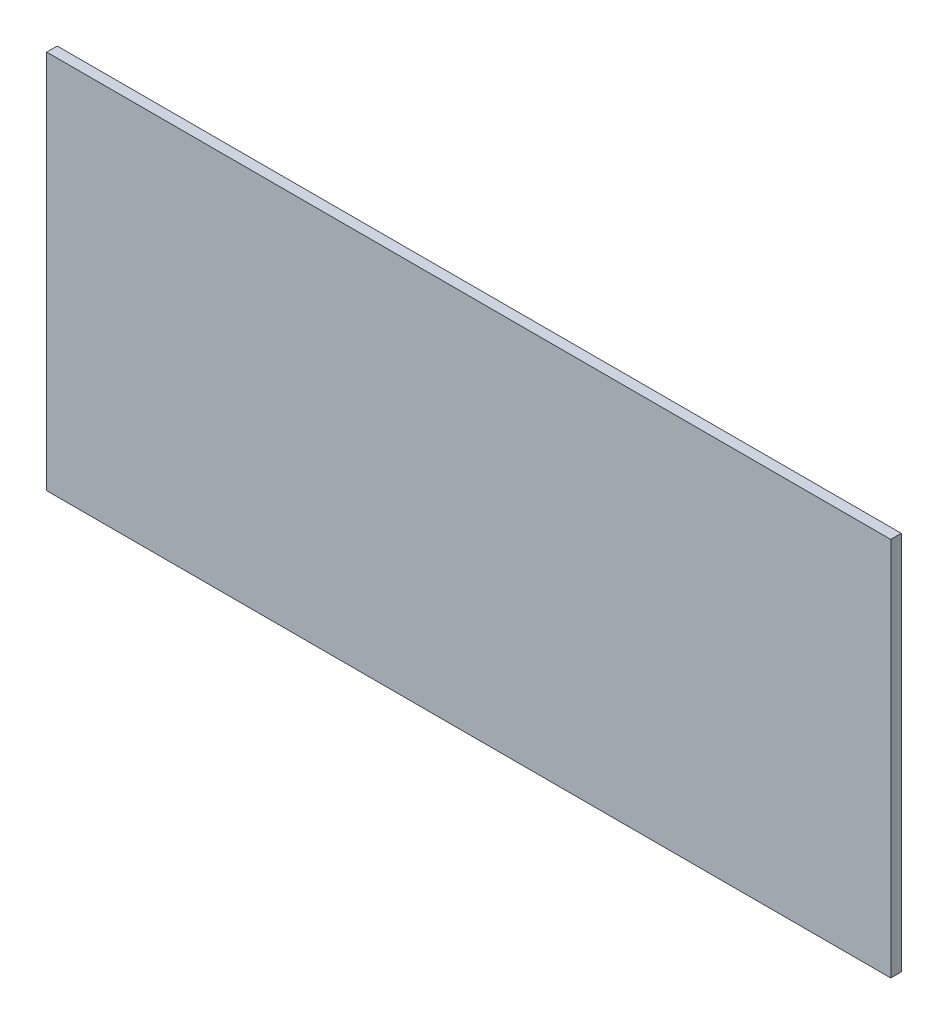
ISO-10303-21;
HEADER;
FILE_DESCRIPTION(('STEP AP214'),'2;1');
FILE_NAME('part.step','',(''),(''),'','','');
FILE_SCHEMA(('AUTOMOTIVE_DESIGN { 1 0 10303 214 1 1 1 1 }'));
ENDSEC;
DATA;
#1=APPLICATION_CONTEXT('core data for automotive mechanical design processes');
#2=APPLICATION_PROTOCOL_DEFINITION('international standard','automotive_design',2000,#1);
#3=PRODUCT_CONTEXT('',#1,'mechanical');
#4=PRODUCT('Part','Part','',(#3));
#5=PRODUCT_RELATED_PRODUCT_CATEGORY('part','',(#4));
#6=PRODUCT_DEFINITION_FORMATION('','',#4);
#7=PRODUCT_DEFINITION_CONTEXT('part definition',#1,'design');
#8=PRODUCT_DEFINITION('design','',#6,#7);
#9=PRODUCT_DEFINITION_SHAPE('','',#8);
#10=(LENGTH_UNIT() NAMED_UNIT(*) SI_UNIT(.MILLI.,.METRE.));
#11=(NAMED_UNIT(*) PLANE_ANGLE_UNIT() SI_UNIT($,.RADIAN.));
#12=(NAMED_UNIT(*) SI_UNIT($,.STERADIAN.) SOLID_ANGLE_UNIT());
#13=UNCERTAINTY_MEASURE_WITH_UNIT(LENGTH_MEASURE(1.E-05),#10,'distance_accuracy_value','');
#14=(GEOMETRIC_REPRESENTATION_CONTEXT(3) GLOBAL_UNCERTAINTY_ASSIGNED_CONTEXT((#13)) GLOBAL_UNIT_ASSIGNED_CONTEXT((#10,
#11,#12)) REPRESENTATION_CONTEXT('',''));
#15=CARTESIAN_POINT('',(0.,0.,0.));
#16=DIRECTION('',(0.,0.,1.));
#17=DIRECTION('',(1.,0.,0.));
#18=AXIS2_PLACEMENT_3D('',#15,#16,#17);
#19=CARTESIAN_POINT('',(0.,0.,25.4));
#20=DIRECTION('',(1.,0.,0.));
#21=DIRECTION('',(0.,1.,0.));
#22=AXIS2_PLACEMENT_3D('',#19,#20,#21);
#23=PLANE('',#22);
#24=DIRECTION('',(0.,-1.,0.));
#25=VECTOR('',#24,1.);
#26=CARTESIAN_POINT('',(0.,0.,0.));
#27=LINE('',#26,#25);
#28=CARTESIAN_POINT('',(0.,0.,0.));
#29=VERTEX_POINT('',#28);
#30=CARTESIAN_POINT('',(1.11981703314034E-13,-914.4,0.));
#31=VERTEX_POINT('',#30);
#32=EDGE_CURVE('E100',#29,#31,#27,.T.);
#33=ORIENTED_EDGE('',*,*,#32,.T.);
#34=DIRECTION('',(0.,0.,-1.));
#35=VECTOR('',#34,1.);
#36=CARTESIAN_POINT('',(1.11981703314034E-13,-914.4,25.4));
#37=LINE('',#36,#35);
#38=CARTESIAN_POINT('',(1.11981703314034E-13,-914.4,25.4));
#39=VERTEX_POINT('',#38);
#40=EDGE_CURVE('E11',#39,#31,#37,.T.);
#41=ORIENTED_EDGE('',*,*,#40,.F.);
#42=DIRECTION('',(0.,-1.,0.));
#43=VECTOR('',#42,1.);
#44=CARTESIAN_POINT('',(0.,0.,25.4));
#45=LINE('',#44,#43);
#46=CARTESIAN_POINT('',(0.,0.,25.4));
#47=VERTEX_POINT('',#46);
#48=EDGE_CURVE('E88',#47,#39,#45,.T.);
#49=ORIENTED_EDGE('',*,*,#48,.F.);
#50=DIRECTION('',(0.,0.,-1.));
#51=VECTOR('',#50,1.);
#52=CARTESIAN_POINT('',(0.,0.,25.4));
#53=LINE('',#52,#51);
#54=EDGE_CURVE('E96',#47,#29,#53,.T.);
#55=ORIENTED_EDGE('',*,*,#54,.T.);
#56=EDGE_LOOP('',(#33,#41,#49,#55));
#57=FACE_BOUND('',#56,.T.);
#58=ADVANCED_FACE('F37',(#57),#23,.F.);
#59=CARTESIAN_POINT('',(1.11981703314034E-13,-914.4,25.4));
#60=DIRECTION('',(0.,1.,0.));
#61=DIRECTION('',(0.,0.,1.));
#62=AXIS2_PLACEMENT_3D('',#59,#60,#61);
#63=PLANE('',#62);
#64=DIRECTION('',(1.,0.,0.));
#65=VECTOR('',#64,1.);
#66=CARTESIAN_POINT('',(1.11981703314034E-13,-914.4,0.));
#67=LINE('',#66,#65);
#68=CARTESIAN_POINT('',(2032.,-914.4,0.));
#69=VERTEX_POINT('',#68);
#70=EDGE_CURVE('E92',#31,#69,#67,.T.);
#71=ORIENTED_EDGE('',*,*,#70,.T.);
#72=DIRECTION('',(0.,0.,-1.));
#73=VECTOR('',#72,1.);
#74=CARTESIAN_POINT('',(2032.,-914.4,25.4));
#75=LINE('',#74,#73);
#76=CARTESIAN_POINT('',(2032.,-914.4,25.4));
#77=VERTEX_POINT('',#76);
#78=EDGE_CURVE('E45',#77,#69,#75,.T.);
#79=ORIENTED_EDGE('',*,*,#78,.F.);
#80=DIRECTION('',(1.,0.,0.));
#81=VECTOR('',#80,1.);
#82=CARTESIAN_POINT('',(1.11981703314034E-13,-914.4,25.4));
#83=LINE('',#82,#81);
#84=EDGE_CURVE('E83',#39,#77,#83,.T.);
#85=ORIENTED_EDGE('',*,*,#84,.F.);
#86=ORIENTED_EDGE('',*,*,#40,.T.);
#87=EDGE_LOOP('',(#71,#79,#85,#86));
#88=FACE_BOUND('',#87,.T.);
#89=ADVANCED_FACE('F91',(#88),#63,.F.);
#90=CARTESIAN_POINT('',(2032.,0.,25.4));
#91=DIRECTION('',(-1.,0.,0.));
#92=DIRECTION('',(0.,0.,1.));
#93=AXIS2_PLACEMENT_3D('',#90,#91,#92);
#94=PLANE('',#93);
#95=DIRECTION('',(0.,1.,0.));
#96=VECTOR('',#95,1.);
#97=CARTESIAN_POINT('',(2032.,0.,0.));
#98=LINE('',#97,#96);
#99=CARTESIAN_POINT('',(2032.,0.,0.));
#100=VERTEX_POINT('',#99);
#101=EDGE_CURVE('E70',#69,#100,#98,.T.);
#102=ORIENTED_EDGE('',*,*,#101,.T.);
#103=DIRECTION('',(0.,0.,-1.));
#104=VECTOR('',#103,1.);
#105=CARTESIAN_POINT('',(2032.,0.,25.4));
#106=LINE('',#105,#104);
#107=CARTESIAN_POINT('',(2032.,0.,25.4));
#108=VERTEX_POINT('',#107);
#109=EDGE_CURVE('E93',#108,#100,#106,.T.);
#110=ORIENTED_EDGE('',*,*,#109,.F.);
#111=DIRECTION('',(0.,1.,0.));
#112=VECTOR('',#111,1.);
#113=CARTESIAN_POINT('',(2032.,0.,25.4));
#114=LINE('',#113,#112);
#115=EDGE_CURVE('E86',#77,#108,#114,.T.);
#116=ORIENTED_EDGE('',*,*,#115,.F.);
#117=ORIENTED_EDGE('',*,*,#78,.T.);
#118=EDGE_LOOP('',(#102,#110,#116,#117));
#119=FACE_BOUND('',#118,.T.);
#120=ADVANCED_FACE('F94',(#119),#94,.F.);
#121=CARTESIAN_POINT('',(0.,0.,25.4));
#122=DIRECTION('',(0.,-1.,0.));
#123=DIRECTION('',(0.,0.,-1.));
#124=AXIS2_PLACEMENT_3D('',#121,#122,#123);
#125=PLANE('',#124);
#126=DIRECTION('',(-1.,0.,0.));
#127=VECTOR('',#126,1.);
#128=CARTESIAN_POINT('',(0.,0.,0.));
#129=LINE('',#128,#127);
#130=EDGE_CURVE('E76',#100,#29,#129,.T.);
#131=ORIENTED_EDGE('',*,*,#130,.T.);
#132=ORIENTED_EDGE('',*,*,#54,.F.);
#133=DIRECTION('',(-1.,0.,0.));
#134=VECTOR('',#133,1.);
#135=CARTESIAN_POINT('',(0.,0.,25.4));
#136=LINE('',#135,#134);
#137=EDGE_CURVE('E53',#108,#47,#136,.T.);
#138=ORIENTED_EDGE('',*,*,#137,.F.);
#139=ORIENTED_EDGE('',*,*,#109,.T.);
#140=EDGE_LOOP('',(#131,#132,#138,#139));
#141=FACE_BOUND('',#140,.T.);
#142=ADVANCED_FACE('F107',(#141),#125,.F.);
#143=CARTESIAN_POINT('',(0.,0.,25.4));
#144=DIRECTION('',(0.,0.,1.));
#145=DIRECTION('',(1.,0.,0.));
#146=AXIS2_PLACEMENT_3D('',#143,#144,#145);
#147=PLANE('',#146);
#148=ORIENTED_EDGE('',*,*,#48,.T.);
#149=ORIENTED_EDGE('',*,*,#84,.T.);
#150=ORIENTED_EDGE('',*,*,#115,.T.);
#151=ORIENTED_EDGE('',*,*,#137,.T.);
#152=EDGE_LOOP('',(#148,#149,#150,#151));
#153=FACE_BOUND('',#152,.T.);
#154=ADVANCED_FACE('F84',(#153),#147,.T.);
#155=CARTESIAN_POINT('',(0.,0.,0.));
#156=DIRECTION('',(0.,0.,1.));
#157=DIRECTION('',(1.,0.,0.));
#158=AXIS2_PLACEMENT_3D('',#155,#156,#157);
#159=PLANE('',#158);
#160=ORIENTED_EDGE('',*,*,#32,.F.);
#161=ORIENTED_EDGE('',*,*,#130,.F.);
#162=ORIENTED_EDGE('',*,*,#101,.F.);
#163=ORIENTED_EDGE('',*,*,#70,.F.);
#164=EDGE_LOOP('',(#160,#161,#162,#163));
#165=FACE_BOUND('',#164,.T.);
#166=ADVANCED_FACE('F110',(#165),#159,.F.);
#167=CLOSED_SHELL('',(#58,#89,#120,#142,#154,#166));
#168=MANIFOLD_SOLID_BREP('B2',#167);
#169=ADVANCED_BREP_SHAPE_REPRESENTATION('',(#18,#168),#14);
#170=SHAPE_DEFINITION_REPRESENTATION(#9,#169);
ENDSEC;
END-ISO-10303-21;
